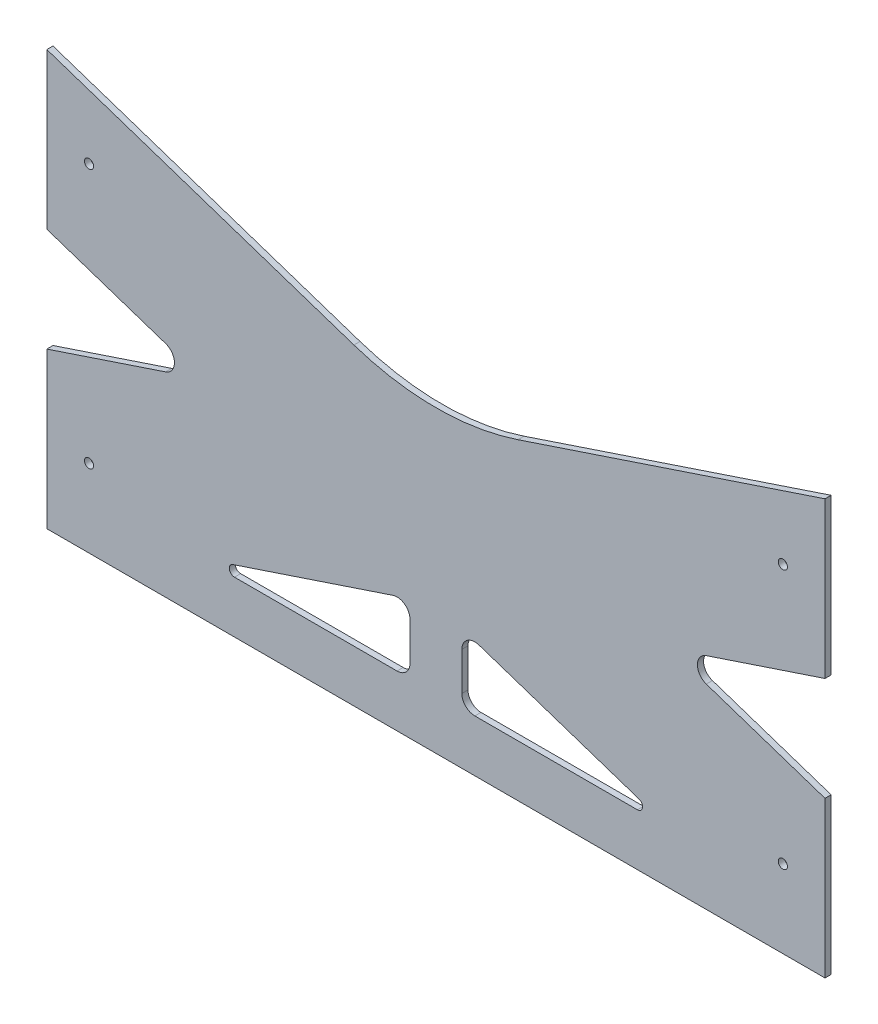
ISO-10303-21;
HEADER;
FILE_DESCRIPTION(('STEP AP214'),'2;1');
FILE_NAME('part.step','',(''),(''),'','','');
FILE_SCHEMA(('AUTOMOTIVE_DESIGN { 1 0 10303 214 1 1 1 1 }'));
ENDSEC;
DATA;
#1=APPLICATION_CONTEXT('core data for automotive mechanical design processes');
#2=APPLICATION_PROTOCOL_DEFINITION('international standard','automotive_design',2000,#1);
#3=PRODUCT_CONTEXT('',#1,'mechanical');
#4=PRODUCT('Part','Part','',(#3));
#5=PRODUCT_RELATED_PRODUCT_CATEGORY('part','',(#4));
#6=PRODUCT_DEFINITION_FORMATION('','',#4);
#7=PRODUCT_DEFINITION_CONTEXT('part definition',#1,'design');
#8=PRODUCT_DEFINITION('design','',#6,#7);
#9=PRODUCT_DEFINITION_SHAPE('','',#8);
#10=(LENGTH_UNIT() NAMED_UNIT(*) SI_UNIT(.MILLI.,.METRE.));
#11=(NAMED_UNIT(*) PLANE_ANGLE_UNIT() SI_UNIT($,.RADIAN.));
#12=(NAMED_UNIT(*) SI_UNIT($,.STERADIAN.) SOLID_ANGLE_UNIT());
#13=UNCERTAINTY_MEASURE_WITH_UNIT(LENGTH_MEASURE(1.E-05),#10,'distance_accuracy_value','');
#14=(GEOMETRIC_REPRESENTATION_CONTEXT(3) GLOBAL_UNCERTAINTY_ASSIGNED_CONTEXT((#13)) GLOBAL_UNIT_ASSIGNED_CONTEXT((#10,
#11,#12)) REPRESENTATION_CONTEXT('',''));
#15=CARTESIAN_POINT('',(0.,0.,0.));
#16=DIRECTION('',(0.,0.,1.));
#17=DIRECTION('',(1.,0.,0.));
#18=AXIS2_PLACEMENT_3D('',#15,#16,#17);
#19=CARTESIAN_POINT('',(-380.999999999886,25.4,195.185873570467));
#20=DIRECTION('',(0.,1.,0.));
#21=DIRECTION('',(1.,0.,-5.93192162057221E-13));
#22=AXIS2_PLACEMENT_3D('',#19,#20,#21);
#23=PLANE('',#22);
#24=DIRECTION('',(-1.,0.,5.93192162057221E-13));
#25=VECTOR('',#24,1.);
#26=CARTESIAN_POINT('',(-381.,25.4,3.00000000011297));
#27=LINE('',#26,#25);
#28=CARTESIAN_POINT('',(-91.8521852568278,25.4,2.99999999994145));
#29=VERTEX_POINT('',#28);
#30=CARTESIAN_POINT('',(-171.45,25.4,2.99999999998866));
#31=VERTEX_POINT('',#30);
#32=EDGE_CURVE('E277',#29,#31,#27,.T.);
#33=ORIENTED_EDGE('',*,*,#32,.F.);
#34=DIRECTION('',(0.,0.,1.));
#35=VECTOR('',#34,1.);
#36=CARTESIAN_POINT('',(-91.8521852568276,25.4,195.185873570467));
#37=LINE('',#36,#35);
#38=CARTESIAN_POINT('',(-91.8521852568278,25.4,-5.85519888599314E-11));
#39=VERTEX_POINT('',#38);
#40=EDGE_CURVE('E382',#29,#39,#37,.F.);
#41=ORIENTED_EDGE('',*,*,#40,.T.);
#42=DIRECTION('',(1.,0.,-5.93192162057221E-13));
#43=VECTOR('',#42,1.);
#44=CARTESIAN_POINT('',(-381.000000000001,25.4,1.12968228521693E-10));
#45=LINE('',#44,#43);
#46=CARTESIAN_POINT('',(-171.45,25.4,-1.13351890373989E-11));
#47=VERTEX_POINT('',#46);
#48=EDGE_CURVE('E272',#47,#39,#45,.T.);
#49=ORIENTED_EDGE('',*,*,#48,.F.);
#50=DIRECTION('',(0.,0.,1.));
#51=VECTOR('',#50,1.);
#52=CARTESIAN_POINT('',(-171.45,25.4,2.99999999999243));
#53=LINE('',#52,#51);
#54=EDGE_CURVE('E332',#47,#31,#53,.T.);
#55=ORIENTED_EDGE('',*,*,#54,.T.);
#56=EDGE_LOOP('',(#33,#41,#49,#55));
#57=FACE_BOUND('',#56,.T.);
#58=ADVANCED_FACE('F45',(#57),#23,.T.);
#59=CARTESIAN_POINT('',(-1.27675647831893E-12,127.,-1.13038051141601E-10));
#60=DIRECTION('',(-0.316227766016838,0.948683298050514,1.87583832226053E-13));
#61=DIRECTION('',(0.948683298050514,0.316227766016838,-5.62751496678159E-13));
#62=AXIS2_PLACEMENT_3D('',#59,#60,#61);
#63=PLANE('',#62);
#64=DIRECTION('',(-0.948683298050514,-0.316227766016838,5.62751496678159E-13));
#65=VECTOR('',#64,1.);
#66=CARTESIAN_POINT('',(4.9960036108132E-13,127.,2.99999999988696));
#67=LINE('',#66,#65);
#68=CARTESIAN_POINT('',(-211.558046314207,56.4806512285976,3.00000000001246));
#69=VERTEX_POINT('',#68);
#70=CARTESIAN_POINT('',(-289.951033268855,30.3496555770483,3.00000000005896));
#71=VERTEX_POINT('',#70);
#72=EDGE_CURVE('E297',#69,#71,#67,.T.);
#73=ORIENTED_EDGE('',*,*,#72,.T.);
#74=DIRECTION('',(-5.93192162057221E-13,0.,-1.));
#75=VECTOR('',#74,1.);
#76=CARTESIAN_POINT('',(-289.951033268857,30.3496555770483,5.89586291738768E-11));
#77=LINE('',#76,#75);
#78=CARTESIAN_POINT('',(-289.951033268856,30.3496555770483,5.89586291738768E-11));
#79=VERTEX_POINT('',#78);
#80=EDGE_CURVE('E384',#71,#79,#77,.T.);
#81=ORIENTED_EDGE('',*,*,#80,.T.);
#82=DIRECTION('',(-0.948683298050514,-0.316227766016838,5.62751496678159E-13));
#83=VECTOR('',#82,1.);
#84=CARTESIAN_POINT('',(-1.27675647831893E-12,127.,-1.13038051141601E-10));
#85=LINE('',#84,#83);
#86=CARTESIAN_POINT('',(-211.558046314207,56.4806512285982,1.24565237521245E-11));
#87=VERTEX_POINT('',#86);
#88=EDGE_CURVE('E283',#87,#79,#85,.T.);
#89=ORIENTED_EDGE('',*,*,#88,.F.);
#90=DIRECTION('',(0.,-1.9773072068574E-13,1.));
#91=VECTOR('',#90,1.);
#92=CARTESIAN_POINT('',(-211.558046314207,56.4806512285982,-1.26981892796459E-10));
#93=LINE('',#92,#91);
#94=EDGE_CURVE('E339',#87,#69,#93,.T.);
#95=ORIENTED_EDGE('',*,*,#94,.T.);
#96=EDGE_LOOP('',(#73,#81,#89,#95));
#97=FACE_BOUND('',#96,.T.);
#98=ADVANCED_FACE('F497',(#97),#63,.F.);
#99=CARTESIAN_POINT('',(4.9960036108132E-13,127.,2.99999999988696));
#100=VERTEX_POINT('',#99);
#101=CARTESIAN_POINT('',(-58.1275831721374,107.624138942621,2.99999999992144));
#102=VERTEX_POINT('',#101);
#103=EDGE_CURVE('E298',#100,#102,#67,.T.);
#104=ORIENTED_EDGE('',*,*,#103,.T.);
#105=DIRECTION('',(2.96596081028611E-13,0.,1.));
#106=VECTOR('',#105,1.);
#107=CARTESIAN_POINT('',(-58.1275831721383,107.624138942621,-7.2601377248204E-11));
#108=LINE('',#107,#106);
#109=CARTESIAN_POINT('',(-58.1275831721383,107.624138942621,-7.85572244045598E-11));
#110=VERTEX_POINT('',#109);
#111=EDGE_CURVE('E348',#102,#110,#108,.F.);
#112=ORIENTED_EDGE('',*,*,#111,.T.);
#113=CARTESIAN_POINT('',(-1.27675647831893E-12,127.,-1.13038051141601E-10));
#114=VERTEX_POINT('',#113);
#115=EDGE_CURVE('E285',#114,#110,#85,.T.);
#116=ORIENTED_EDGE('',*,*,#115,.F.);
#117=DIRECTION('',(5.93192162057221E-13,0.,1.));
#118=VECTOR('',#117,1.);
#119=CARTESIAN_POINT('',(-1.27675647831893E-12,127.,-1.13038051141601E-10));
#120=LINE('',#119,#118);
#121=EDGE_CURVE('E312',#114,#100,#120,.T.);
#122=ORIENTED_EDGE('',*,*,#121,.T.);
#123=EDGE_LOOP('',(#104,#112,#116,#122));
#124=FACE_BOUND('',#123,.T.);
#125=ADVANCED_FACE('F467',(#124),#63,.F.);
#126=CARTESIAN_POINT('',(-381.000000000001,76.2,1.12968228521693E-10));
#127=DIRECTION('',(0.316227766016838,-0.948683298050514,-1.87583832226053E-13));
#128=DIRECTION('',(-0.948683298050514,-0.316227766016838,5.62751496678159E-13));
#129=AXIS2_PLACEMENT_3D('',#126,#127,#128);
#130=PLANE('',#129);
#131=DIRECTION('',(0.948683298050514,0.316227766016838,-5.62751496678159E-13));
#132=VECTOR('',#131,1.);
#133=CARTESIAN_POINT('',(-381.,76.2,3.00000000011297));
#134=LINE('',#133,#132);
#135=CARTESIAN_POINT('',(-381.,76.2,3.00000000011297));
#136=VERTEX_POINT('',#135);
#137=CARTESIAN_POINT('',(-322.872416827862,95.5758610573791,3.00000000007849));
#138=VERTEX_POINT('',#137);
#139=EDGE_CURVE('E284',#136,#138,#134,.T.);
#140=ORIENTED_EDGE('',*,*,#139,.T.);
#141=DIRECTION('',(2.96596081028611E-13,0.,1.));
#142=VECTOR('',#141,1.);
#143=CARTESIAN_POINT('',(-322.872416827863,95.5758610573794,7.25315546282959E-11));
#144=LINE('',#143,#142);
#145=CARTESIAN_POINT('',(-322.872416827863,95.5758610573794,7.8487401784651E-11));
#146=VERTEX_POINT('',#145);
#147=EDGE_CURVE('E353',#138,#146,#144,.F.);
#148=ORIENTED_EDGE('',*,*,#147,.T.);
#149=DIRECTION('',(0.948683298050514,0.316227766016838,-5.62751496678159E-13));
#150=VECTOR('',#149,1.);
#151=CARTESIAN_POINT('',(-381.000000000001,76.2,1.12968228521693E-10));
#152=LINE('',#151,#150);
#153=CARTESIAN_POINT('',(-381.000000000001,76.2,1.12968228521693E-10));
#154=VERTEX_POINT('',#153);
#155=EDGE_CURVE('E291',#154,#146,#152,.T.);
#156=ORIENTED_EDGE('',*,*,#155,.F.);
#157=DIRECTION('',(5.93192162057221E-13,0.,1.));
#158=VECTOR('',#157,1.);
#159=CARTESIAN_POINT('',(-381.000000000001,76.2,1.12968228521693E-10));
#160=LINE('',#159,#158);
#161=EDGE_CURVE('E307',#154,#136,#160,.T.);
#162=ORIENTED_EDGE('',*,*,#161,.T.);
#163=EDGE_LOOP('',(#140,#148,#156,#162));
#164=FACE_BOUND('',#163,.T.);
#165=ADVANCED_FACE('F453',(#164),#130,.F.);
#166=CARTESIAN_POINT('',(-150.339073715862,153.086975428046,-2.38580250429171E-11));
#167=VERTEX_POINT('',#166);
#168=CARTESIAN_POINT('',(-1.27675647831893E-12,203.2,-1.13038051141601E-10));
#169=VERTEX_POINT('',#168);
#170=EDGE_CURVE('E290',#167,#169,#152,.T.);
#171=ORIENTED_EDGE('',*,*,#170,.F.);
#172=DIRECTION('',(-2.96596081028611E-13,0.,-1.));
#173=VECTOR('',#172,1.);
#174=CARTESIAN_POINT('',(-150.339073715861,153.086975428046,2.99999999998938));
#175=LINE('',#174,#173);
#176=CARTESIAN_POINT('',(-150.339073715862,153.086975428046,2.99999999997614));
#177=VERTEX_POINT('',#176);
#178=EDGE_CURVE('E318',#167,#177,#175,.F.);
#179=ORIENTED_EDGE('',*,*,#178,.T.);
#180=CARTESIAN_POINT('',(4.9960036108132E-13,203.2,2.99999999988696));
#181=VERTEX_POINT('',#180);
#182=EDGE_CURVE('E302',#177,#181,#134,.T.);
#183=ORIENTED_EDGE('',*,*,#182,.T.);
#184=DIRECTION('',(5.93192162057221E-13,0.,1.));
#185=VECTOR('',#184,1.);
#186=CARTESIAN_POINT('',(-1.27675647831893E-12,203.2,-1.13038051141601E-10));
#187=LINE('',#186,#185);
#188=EDGE_CURVE('E294',#169,#181,#187,.T.);
#189=ORIENTED_EDGE('',*,*,#188,.F.);
#190=EDGE_LOOP('',(#171,#179,#183,#189));
#191=FACE_BOUND('',#190,.T.);
#192=ADVANCED_FACE('F486',(#191),#130,.F.);
#193=CARTESIAN_POINT('',(-1.27675647831893E-12,203.2,-1.13038051141601E-10));
#194=DIRECTION('',(-1.,0.,5.93192162057221E-13));
#195=DIRECTION('',(5.93192162057221E-13,0.,1.));
#196=AXIS2_PLACEMENT_3D('',#193,#194,#195);
#197=PLANE('',#196);
#198=DIRECTION('',(0.,-1.,0.));
#199=VECTOR('',#198,1.);
#200=CARTESIAN_POINT('',(4.9960036108132E-13,203.2,2.99999999988696));
#201=LINE('',#200,#199);
#202=EDGE_CURVE('E279',#181,#100,#201,.T.);
#203=ORIENTED_EDGE('',*,*,#202,.T.);
#204=ORIENTED_EDGE('',*,*,#121,.F.);
#205=DIRECTION('',(0.,-1.,0.));
#206=VECTOR('',#205,1.);
#207=CARTESIAN_POINT('',(-1.27675647831893E-12,203.2,-1.13038051141601E-10));
#208=LINE('',#207,#206);
#209=EDGE_CURVE('E280',#169,#114,#208,.T.);
#210=ORIENTED_EDGE('',*,*,#209,.F.);
#211=ORIENTED_EDGE('',*,*,#188,.T.);
#212=EDGE_LOOP('',(#203,#204,#210,#211));
#213=FACE_BOUND('',#212,.T.);
#214=ADVANCED_FACE('F475',(#213),#197,.F.);
#215=CARTESIAN_POINT('',(-381.000000000001,0.,1.12968228521693E-10));
#216=DIRECTION('',(1.,0.,-5.93192162057221E-13));
#217=DIRECTION('',(0.,-1.,0.));
#218=AXIS2_PLACEMENT_3D('',#215,#216,#217);
#219=PLANE('',#218);
#220=ORIENTED_EDGE('',*,*,#161,.F.);
#221=DIRECTION('',(0.,1.,0.));
#222=VECTOR('',#221,1.);
#223=CARTESIAN_POINT('',(-381.000000000001,0.,1.12968228521693E-10));
#224=LINE('',#223,#222);
#225=CARTESIAN_POINT('',(-381.000000000001,0.,1.12968228521693E-10));
#226=VERTEX_POINT('',#225);
#227=EDGE_CURVE('E288',#226,#154,#224,.T.);
#228=ORIENTED_EDGE('',*,*,#227,.F.);
#229=DIRECTION('',(5.93192162057221E-13,0.,1.));
#230=VECTOR('',#229,1.);
#231=CARTESIAN_POINT('',(-381.000000000001,0.,1.12968228521693E-10));
#232=LINE('',#231,#230);
#233=CARTESIAN_POINT('',(-381.,0.,3.00000000011297));
#234=VERTEX_POINT('',#233);
#235=EDGE_CURVE('E310',#226,#234,#232,.T.);
#236=ORIENTED_EDGE('',*,*,#235,.T.);
#237=DIRECTION('',(0.,1.,0.));
#238=VECTOR('',#237,1.);
#239=CARTESIAN_POINT('',(-381.,0.,3.00000000011297));
#240=LINE('',#239,#238);
#241=EDGE_CURVE('E224',#234,#136,#240,.T.);
#242=ORIENTED_EDGE('',*,*,#241,.T.);
#243=EDGE_LOOP('',(#220,#228,#236,#242));
#244=FACE_BOUND('',#243,.T.);
#245=ADVANCED_FACE('F458',(#244),#219,.F.);
#246=CARTESIAN_POINT('',(-381.000000000001,0.,1.12968228521693E-10));
#247=DIRECTION('',(-5.93192162057221E-13,0.,-1.));
#248=DIRECTION('',(-1.,0.,5.93192162057221E-13));
#249=AXIS2_PLACEMENT_3D('',#246,#247,#248);
#250=PLANE('',#249);
#251=CARTESIAN_POINT('',(-20.6375000000011,165.1,1.22420149092173E-11));
#252=DIRECTION('',(0.,0.,-1.));
#253=DIRECTION('',(-1.,0.,0.));
#254=AXIS2_PLACEMENT_3D('',#251,#252,#253);
#255=CIRCLE('',#254,2.2479);
#256=CARTESIAN_POINT('',(-22.8854000000011,165.1,1.22420149092173E-11));
#257=VERTEX_POINT('',#256);
#258=EDGE_CURVE('E542',#257,#257,#255,.T.);
#259=ORIENTED_EDGE('',*,*,#258,.F.);
#260=EDGE_LOOP('',(#259));
#261=FACE_BOUND('',#260,.T.);
#262=CARTESIAN_POINT('',(-360.3625,165.1,2.13764222164106E-10));
#263=DIRECTION('',(0.,0.,-1.));
#264=DIRECTION('',(-1.,0.,0.));
#265=AXIS2_PLACEMENT_3D('',#262,#263,#264);
#266=CIRCLE('',#265,2.24790000000002);
#267=CARTESIAN_POINT('',(-362.6104,165.1,2.13764222164106E-10));
#268=VERTEX_POINT('',#267);
#269=EDGE_CURVE('E546',#268,#268,#266,.T.);
#270=ORIENTED_EDGE('',*,*,#269,.F.);
#271=EDGE_LOOP('',(#270));
#272=FACE_BOUND('',#271,.T.);
#273=CARTESIAN_POINT('',(-20.6375000000011,38.1,1.22420149092173E-11));
#274=DIRECTION('',(0.,0.,-1.));
#275=DIRECTION('',(-1.,0.,0.));
#276=AXIS2_PLACEMENT_3D('',#273,#274,#275);
#277=CIRCLE('',#276,2.2479);
#278=CARTESIAN_POINT('',(-22.8854000000011,38.1,1.22420149092173E-11));
#279=VERTEX_POINT('',#278);
#280=EDGE_CURVE('E550',#279,#279,#277,.T.);
#281=ORIENTED_EDGE('',*,*,#280,.F.);
#282=EDGE_LOOP('',(#281));
#283=FACE_BOUND('',#282,.T.);
#284=CARTESIAN_POINT('',(-360.3625,38.1,2.13764222164106E-10));
#285=DIRECTION('',(0.,0.,-1.));
#286=DIRECTION('',(-1.,0.,0.));
#287=AXIS2_PLACEMENT_3D('',#284,#285,#286);
#288=CIRCLE('',#287,2.24790000000002);
#289=CARTESIAN_POINT('',(-362.6104,38.1,2.13764222164106E-10));
#290=VERTEX_POINT('',#289);
#291=EDGE_CURVE('E553',#290,#290,#288,.T.);
#292=ORIENTED_EDGE('',*,*,#291,.F.);
#293=EDGE_LOOP('',(#292));
#294=FACE_BOUND('',#293,.T.);
#295=DIRECTION('',(0.,-1.,0.));
#296=VECTOR('',#295,1.);
#297=CARTESIAN_POINT('',(-203.2,63.4999999999999,7.49400541621981E-12));
#298=LINE('',#297,#296);
#299=CARTESIAN_POINT('',(-203.2,50.4565122859775,7.4940054162198E-12));
#300=VERTEX_POINT('',#299);
#301=CARTESIAN_POINT('',(-203.2,31.75,7.49400541621979E-12));
#302=VERTEX_POINT('',#301);
#303=EDGE_CURVE('E257',#300,#302,#298,.T.);
#304=ORIENTED_EDGE('',*,*,#303,.F.);
#305=CARTESIAN_POINT('',(-209.55,50.4565122859774,1.12654323369811E-11));
#306=DIRECTION('',(-5.93192162057221E-13,0.,-1.));
#307=DIRECTION('',(-1.,0.,5.93192162057221E-13));
#308=AXIS2_PLACEMENT_3D('',#305,#306,#307);
#309=CIRCLE('',#308,6.35);
#310=EDGE_CURVE('E365',#300,#87,#309,.F.);
#311=ORIENTED_EDGE('',*,*,#310,.T.);
#312=ORIENTED_EDGE('',*,*,#88,.T.);
#313=CARTESIAN_POINT('',(-289.147814743174,27.94,5.84822321595147E-11));
#314=DIRECTION('',(-5.93192162057221E-13,0.,-1.));
#315=DIRECTION('',(-1.,0.,5.93192162057221E-13));
#316=AXIS2_PLACEMENT_3D('',#313,#314,#315);
#317=CIRCLE('',#316,2.54);
#318=CARTESIAN_POINT('',(-289.147814743174,25.4,5.84822321595147E-11));
#319=VERTEX_POINT('',#318);
#320=EDGE_CURVE('E53',#79,#319,#317,.F.);
#321=ORIENTED_EDGE('',*,*,#320,.T.);
#322=CARTESIAN_POINT('',(-209.55,25.4,1.12654323369811E-11));
#323=VERTEX_POINT('',#322);
#324=EDGE_CURVE('E274',#319,#323,#45,.T.);
#325=ORIENTED_EDGE('',*,*,#324,.T.);
#326=CARTESIAN_POINT('',(-209.55,31.75,1.12618248060414E-11));
#327=DIRECTION('',(-5.93192162057221E-13,0.,-1.));
#328=DIRECTION('',(-1.,0.,5.93192162057221E-13));
#329=AXIS2_PLACEMENT_3D('',#326,#327,#328);
#330=CIRCLE('',#329,6.35);
#331=EDGE_CURVE('E357',#323,#302,#330,.F.);
#332=ORIENTED_EDGE('',*,*,#331,.T.);
#333=EDGE_LOOP('',(#304,#311,#312,#321,#325,#332));
#334=FACE_BOUND('',#333,.T.);
#335=DIRECTION('',(0.948683298050514,-0.316227766016838,0.));
#336=VECTOR('',#335,1.);
#337=CARTESIAN_POINT('',(-381.,127.,0.));
#338=LINE('',#337,#336);
#339=CARTESIAN_POINT('',(-169.441953685793,56.4806512285976,0.));
#340=VERTEX_POINT('',#339);
#341=CARTESIAN_POINT('',(-91.0489667311449,30.3496555770483,0.));
#342=VERTEX_POINT('',#341);
#343=EDGE_CURVE('E256',#340,#342,#338,.T.);
#344=ORIENTED_EDGE('',*,*,#343,.F.);
#345=CARTESIAN_POINT('',(-171.45,50.4565122859768,-1.13351168729015E-11));
#346=DIRECTION('',(-5.93192162057221E-13,0.,-1.));
#347=DIRECTION('',(-1.,0.,5.93192162057221E-13));
#348=AXIS2_PLACEMENT_3D('',#345,#346,#347);
#349=CIRCLE('',#348,6.35);
#350=CARTESIAN_POINT('',(-177.8,50.4565122859768,-7.57033324916278E-12));
#351=VERTEX_POINT('',#350);
#352=EDGE_CURVE('E367',#340,#351,#349,.F.);
#353=ORIENTED_EDGE('',*,*,#352,.T.);
#354=DIRECTION('',(0.,1.,0.));
#355=VECTOR('',#354,1.);
#356=CARTESIAN_POINT('',(-177.8,63.4999999999999,-7.57033324916279E-12));
#357=LINE('',#356,#355);
#358=CARTESIAN_POINT('',(-177.8,31.75,-7.57033324916277E-12));
#359=VERTEX_POINT('',#358);
#360=EDGE_CURVE('E426',#359,#351,#357,.T.);
#361=ORIENTED_EDGE('',*,*,#360,.F.);
#362=CARTESIAN_POINT('',(-171.45,31.75,-1.13520304267922E-11));
#363=DIRECTION('',(-5.93192162057221E-13,0.,-1.));
#364=DIRECTION('',(-1.,0.,5.93192162057221E-13));
#365=AXIS2_PLACEMENT_3D('',#362,#363,#364);
#366=CIRCLE('',#365,6.35);
#367=EDGE_CURVE('E361',#359,#47,#366,.F.);
#368=ORIENTED_EDGE('',*,*,#367,.T.);
#369=ORIENTED_EDGE('',*,*,#48,.T.);
#370=CARTESIAN_POINT('',(-91.8521852568276,27.94,-5.85521214846452E-11));
#371=DIRECTION('',(-5.93192162057221E-13,0.,-1.));
#372=DIRECTION('',(-1.,0.,5.93192162057221E-13));
#373=AXIS2_PLACEMENT_3D('',#370,#371,#372);
#374=CIRCLE('',#373,2.54);
#375=EDGE_CURVE('E390',#39,#342,#374,.F.);
#376=ORIENTED_EDGE('',*,*,#375,.T.);
#377=EDGE_LOOP('',(#344,#353,#361,#368,#369,#376));
#378=FACE_BOUND('',#377,.T.);
#379=ORIENTED_EDGE('',*,*,#155,.T.);
#380=CARTESIAN_POINT('',(-324.88046314207,101.6,7.96784513368287E-11));
#381=DIRECTION('',(-5.93192162057221E-13,0.,-1.));
#382=DIRECTION('',(-1.,0.,5.93192162057221E-13));
#383=AXIS2_PLACEMENT_3D('',#380,#381,#382);
#384=CIRCLE('',#383,6.35);
#385=CARTESIAN_POINT('',(-322.872416827863,107.624138942621,0.));
#386=VERTEX_POINT('',#385);
#387=EDGE_CURVE('E377',#146,#386,#384,.F.);
#388=ORIENTED_EDGE('',*,*,#387,.T.);
#389=CARTESIAN_POINT('',(-381.,127.,0.));
#390=VERTEX_POINT('',#389);
#391=EDGE_CURVE('E258',#390,#386,#338,.T.);
#392=ORIENTED_EDGE('',*,*,#391,.F.);
#393=DIRECTION('',(0.,-1.,0.));
#394=VECTOR('',#393,1.);
#395=CARTESIAN_POINT('',(-381.,203.2,0.));
#396=LINE('',#395,#394);
#397=CARTESIAN_POINT('',(-381.,203.2,0.));
#398=VERTEX_POINT('',#397);
#399=EDGE_CURVE('E253',#398,#390,#396,.T.);
#400=ORIENTED_EDGE('',*,*,#399,.F.);
#401=DIRECTION('',(-0.948683298050514,0.316227766016838,0.));
#402=VECTOR('',#401,1.);
#403=CARTESIAN_POINT('',(0.,76.2,0.));
#404=LINE('',#403,#402);
#405=CARTESIAN_POINT('',(-230.660926284139,153.086975428046,0.));
#406=VERTEX_POINT('',#405);
#407=EDGE_CURVE('E263',#406,#398,#404,.T.);
#408=ORIENTED_EDGE('',*,*,#407,.F.);
#409=CARTESIAN_POINT('',(-190.500000000001,273.569754280462,0.));
#410=DIRECTION('',(-5.93192162057221E-13,0.,-1.));
#411=DIRECTION('',(-1.,0.,5.93192162057221E-13));
#412=AXIS2_PLACEMENT_3D('',#409,#410,#411);
#413=CIRCLE('',#412,127.);
#414=EDGE_CURVE('E320',#406,#167,#413,.F.);
#415=ORIENTED_EDGE('',*,*,#414,.T.);
#416=ORIENTED_EDGE('',*,*,#170,.T.);
#417=ORIENTED_EDGE('',*,*,#209,.T.);
#418=ORIENTED_EDGE('',*,*,#115,.T.);
#419=CARTESIAN_POINT('',(-56.1195368579314,101.6,-7.97482739567368E-11));
#420=DIRECTION('',(-5.93192162057221E-13,0.,-1.));
#421=DIRECTION('',(-1.,0.,5.93192162057221E-13));
#422=AXIS2_PLACEMENT_3D('',#419,#420,#421);
#423=CIRCLE('',#422,6.35);
#424=CARTESIAN_POINT('',(-58.1275831721383,95.5758610573794,0.));
#425=VERTEX_POINT('',#424);
#426=EDGE_CURVE('E373',#110,#425,#423,.F.);
#427=ORIENTED_EDGE('',*,*,#426,.T.);
#428=CARTESIAN_POINT('',(0.,76.2,0.));
#429=VERTEX_POINT('',#428);
#430=EDGE_CURVE('E264',#429,#425,#404,.T.);
#431=ORIENTED_EDGE('',*,*,#430,.F.);
#432=DIRECTION('',(0.,1.,0.));
#433=VECTOR('',#432,1.);
#434=CARTESIAN_POINT('',(0.,0.,0.));
#435=LINE('',#434,#433);
#436=CARTESIAN_POINT('',(0.,0.,0.));
#437=VERTEX_POINT('',#436);
#438=EDGE_CURVE('E261',#437,#429,#435,.T.);
#439=ORIENTED_EDGE('',*,*,#438,.F.);
#440=DIRECTION('',(-1.,0.,5.93192162057221E-13));
#441=VECTOR('',#440,1.);
#442=CARTESIAN_POINT('',(-381.000000000001,0.,1.12968228521693E-10));
#443=LINE('',#442,#441);
#444=EDGE_CURVE('E228',#437,#226,#443,.T.);
#445=ORIENTED_EDGE('',*,*,#444,.T.);
#446=ORIENTED_EDGE('',*,*,#227,.T.);
#447=EDGE_LOOP('',(#379,#388,#392,#400,#408,#415,#416,#417,#418,#427,#431,#439,#445,#446));
#448=FACE_BOUND('',#447,.T.);
#449=ADVANCED_FACE('F396',(#261,#272,#283,#294,#334,#378,#448),#250,.T.);
#450=CARTESIAN_POINT('',(-381.,0.,3.00000000011297));
#451=DIRECTION('',(-5.93192162057221E-13,0.,-1.));
#452=DIRECTION('',(-1.,0.,5.93192162057221E-13));
#453=AXIS2_PLACEMENT_3D('',#450,#451,#452);
#454=PLANE('',#453);
#455=CARTESIAN_POINT('',(-20.6375000000011,165.1,3.00000000012521));
#456=DIRECTION('',(0.,0.,-1.));
#457=DIRECTION('',(-1.,0.,0.));
#458=AXIS2_PLACEMENT_3D('',#455,#456,#457);
#459=CIRCLE('',#458,2.2479);
#460=CARTESIAN_POINT('',(-22.8854000000011,165.1,3.00000000012521));
#461=VERTEX_POINT('',#460);
#462=EDGE_CURVE('E565',#461,#461,#459,.T.);
#463=ORIENTED_EDGE('',*,*,#462,.T.);
#464=EDGE_LOOP('',(#463));
#465=FACE_BOUND('',#464,.T.);
#466=CARTESIAN_POINT('',(-360.3625,165.1,3.00000000032673));
#467=DIRECTION('',(0.,0.,-1.));
#468=DIRECTION('',(-1.,0.,0.));
#469=AXIS2_PLACEMENT_3D('',#466,#467,#468);
#470=CIRCLE('',#469,2.24790000000002);
#471=CARTESIAN_POINT('',(-362.6104,165.1,3.00000000032673));
#472=VERTEX_POINT('',#471);
#473=EDGE_CURVE('E561',#472,#472,#470,.T.);
#474=ORIENTED_EDGE('',*,*,#473,.T.);
#475=EDGE_LOOP('',(#474));
#476=FACE_BOUND('',#475,.T.);
#477=CARTESIAN_POINT('',(-20.6375000000011,38.1,3.00000000012521));
#478=DIRECTION('',(0.,0.,-1.));
#479=DIRECTION('',(-1.,0.,0.));
#480=AXIS2_PLACEMENT_3D('',#477,#478,#479);
#481=CIRCLE('',#480,2.2479);
#482=CARTESIAN_POINT('',(-22.8854000000011,38.1,3.00000000012521));
#483=VERTEX_POINT('',#482);
#484=EDGE_CURVE('E555',#483,#483,#481,.T.);
#485=ORIENTED_EDGE('',*,*,#484,.T.);
#486=EDGE_LOOP('',(#485));
#487=FACE_BOUND('',#486,.T.);
#488=CARTESIAN_POINT('',(-360.3625,38.1,3.00000000032673));
#489=DIRECTION('',(0.,0.,-1.));
#490=DIRECTION('',(-1.,0.,0.));
#491=AXIS2_PLACEMENT_3D('',#488,#489,#490);
#492=CIRCLE('',#491,2.24790000000002);
#493=CARTESIAN_POINT('',(-362.6104,38.1,3.00000000032673));
#494=VERTEX_POINT('',#493);
#495=EDGE_CURVE('E431',#494,#494,#492,.T.);
#496=ORIENTED_EDGE('',*,*,#495,.T.);
#497=EDGE_LOOP('',(#496));
#498=FACE_BOUND('',#497,.T.);
#499=ORIENTED_EDGE('',*,*,#72,.F.);
#500=CARTESIAN_POINT('',(-209.55,50.4565122859769,3.00000000001126));
#501=DIRECTION('',(-5.93192162057221E-13,0.,-1.));
#502=DIRECTION('',(-1.,0.,5.93192162057221E-13));
#503=AXIS2_PLACEMENT_3D('',#500,#501,#502);
#504=CIRCLE('',#503,6.35);
#505=CARTESIAN_POINT('',(-203.2,50.4565122859769,2.99999999988696));
#506=VERTEX_POINT('',#505);
#507=EDGE_CURVE('E363',#69,#506,#504,.T.);
#508=ORIENTED_EDGE('',*,*,#507,.T.);
#509=DIRECTION('',(0.,-1.,0.));
#510=VECTOR('',#509,1.);
#511=CARTESIAN_POINT('',(-203.2,63.4999999999999,2.99999999988696));
#512=LINE('',#511,#510);
#513=CARTESIAN_POINT('',(-203.2,31.75,2.99999999988696));
#514=VERTEX_POINT('',#513);
#515=EDGE_CURVE('E427',#506,#514,#512,.T.);
#516=ORIENTED_EDGE('',*,*,#515,.T.);
#517=CARTESIAN_POINT('',(-209.55,31.75,3.00000000001126));
#518=DIRECTION('',(-5.93192162057221E-13,0.,-1.));
#519=DIRECTION('',(-1.,0.,5.93192162057221E-13));
#520=AXIS2_PLACEMENT_3D('',#517,#518,#519);
#521=CIRCLE('',#520,6.35);
#522=CARTESIAN_POINT('',(-209.55,25.4,3.00000000001126));
#523=VERTEX_POINT('',#522);
#524=EDGE_CURVE('E355',#514,#523,#521,.T.);
#525=ORIENTED_EDGE('',*,*,#524,.T.);
#526=CARTESIAN_POINT('',(-289.147814743172,25.4,3.00000000005848));
#527=VERTEX_POINT('',#526);
#528=EDGE_CURVE('E227',#523,#527,#27,.T.);
#529=ORIENTED_EDGE('',*,*,#528,.T.);
#530=CARTESIAN_POINT('',(-289.147814743172,27.94,3.00000000005848));
#531=DIRECTION('',(-5.93192162057221E-13,0.,-1.));
#532=DIRECTION('',(-1.,0.,5.93192162057221E-13));
#533=AXIS2_PLACEMENT_3D('',#530,#531,#532);
#534=CIRCLE('',#533,2.54);
#535=EDGE_CURVE('E11',#527,#71,#534,.T.);
#536=ORIENTED_EDGE('',*,*,#535,.T.);
#537=EDGE_LOOP('',(#499,#508,#516,#525,#529,#536));
#538=FACE_BOUND('',#537,.T.);
#539=DIRECTION('',(0.948683298050514,-0.316227766016838,0.));
#540=VECTOR('',#539,1.);
#541=CARTESIAN_POINT('',(-381.,127.,3.));
#542=LINE('',#541,#540);
#543=CARTESIAN_POINT('',(-169.441953685793,56.4806512285976,3.));
#544=VERTEX_POINT('',#543);
#545=CARTESIAN_POINT('',(-91.0489667311449,30.3496555770483,3.));
#546=VERTEX_POINT('',#545);
#547=EDGE_CURVE('E248',#544,#546,#542,.T.);
#548=ORIENTED_EDGE('',*,*,#547,.T.);
#549=CARTESIAN_POINT('',(-91.8521852568276,27.94,2.99999999994145));
#550=DIRECTION('',(-5.93192162057221E-13,0.,-1.));
#551=DIRECTION('',(-1.,0.,5.93192162057221E-13));
#552=AXIS2_PLACEMENT_3D('',#549,#550,#551);
#553=CIRCLE('',#552,2.54);
#554=EDGE_CURVE('E388',#546,#29,#553,.T.);
#555=ORIENTED_EDGE('',*,*,#554,.T.);
#556=ORIENTED_EDGE('',*,*,#32,.T.);
#557=CARTESIAN_POINT('',(-171.45,31.75,2.99999999998865));
#558=DIRECTION('',(-5.93192162057221E-13,0.,-1.));
#559=DIRECTION('',(-1.,0.,5.93192162057221E-13));
#560=AXIS2_PLACEMENT_3D('',#557,#558,#559);
#561=CIRCLE('',#560,6.35);
#562=CARTESIAN_POINT('',(-177.8,31.75,2.99999999988696));
#563=VERTEX_POINT('',#562);
#564=EDGE_CURVE('E359',#31,#563,#561,.T.);
#565=ORIENTED_EDGE('',*,*,#564,.T.);
#566=DIRECTION('',(0.,1.,0.));
#567=VECTOR('',#566,1.);
#568=CARTESIAN_POINT('',(-177.8,63.4999999999999,2.99999999988696));
#569=LINE('',#568,#567);
#570=CARTESIAN_POINT('',(-177.8,50.4565122859768,2.99999999988696));
#571=VERTEX_POINT('',#570);
#572=EDGE_CURVE('E419',#563,#571,#569,.T.);
#573=ORIENTED_EDGE('',*,*,#572,.T.);
#574=CARTESIAN_POINT('',(-171.45,50.4565122859768,2.99999999998866));
#575=DIRECTION('',(-5.93192162057221E-13,0.,-1.));
#576=DIRECTION('',(-1.,0.,5.93192162057221E-13));
#577=AXIS2_PLACEMENT_3D('',#574,#575,#576);
#578=CIRCLE('',#577,6.35);
#579=EDGE_CURVE('E369',#571,#544,#578,.T.);
#580=ORIENTED_EDGE('',*,*,#579,.T.);
#581=EDGE_LOOP('',(#548,#555,#556,#565,#573,#580));
#582=FACE_BOUND('',#581,.T.);
#583=DIRECTION('',(1.,0.,-5.93192162057221E-13));
#584=VECTOR('',#583,1.);
#585=CARTESIAN_POINT('',(-381.,0.,3.00000000011297));
#586=LINE('',#585,#584);
#587=CARTESIAN_POINT('',(0.,0.,3.));
#588=VERTEX_POINT('',#587);
#589=EDGE_CURVE('E216',#234,#588,#586,.T.);
#590=ORIENTED_EDGE('',*,*,#589,.T.);
#591=DIRECTION('',(0.,1.,0.));
#592=VECTOR('',#591,1.);
#593=CARTESIAN_POINT('',(0.,0.,3.));
#594=LINE('',#593,#592);
#595=CARTESIAN_POINT('',(0.,76.2,3.));
#596=VERTEX_POINT('',#595);
#597=EDGE_CURVE('E221',#588,#596,#594,.T.);
#598=ORIENTED_EDGE('',*,*,#597,.T.);
#599=DIRECTION('',(-0.948683298050514,0.316227766016838,0.));
#600=VECTOR('',#599,1.);
#601=CARTESIAN_POINT('',(0.,76.2,3.));
#602=LINE('',#601,#600);
#603=CARTESIAN_POINT('',(-58.1275831721374,95.5758610573791,3.));
#604=VERTEX_POINT('',#603);
#605=EDGE_CURVE('E245',#596,#604,#602,.T.);
#606=ORIENTED_EDGE('',*,*,#605,.T.);
#607=CARTESIAN_POINT('',(-56.1195368579305,101.6,2.99999999992025));
#608=DIRECTION('',(-5.93192162057221E-13,0.,-1.));
#609=DIRECTION('',(-1.,0.,5.93192162057221E-13));
#610=AXIS2_PLACEMENT_3D('',#607,#608,#609);
#611=CIRCLE('',#610,6.35);
#612=EDGE_CURVE('E371',#604,#102,#611,.T.);
#613=ORIENTED_EDGE('',*,*,#612,.T.);
#614=ORIENTED_EDGE('',*,*,#103,.F.);
#615=ORIENTED_EDGE('',*,*,#202,.F.);
#616=ORIENTED_EDGE('',*,*,#182,.F.);
#617=CARTESIAN_POINT('',(-190.5,273.569754280461,2.99999999999996));
#618=DIRECTION('',(-5.93192162057221E-13,0.,-1.));
#619=DIRECTION('',(-1.,0.,5.93192162057221E-13));
#620=AXIS2_PLACEMENT_3D('',#617,#618,#619);
#621=CIRCLE('',#620,127.);
#622=CARTESIAN_POINT('',(-230.660926284138,153.086975428046,3.));
#623=VERTEX_POINT('',#622);
#624=EDGE_CURVE('E322',#177,#623,#621,.T.);
#625=ORIENTED_EDGE('',*,*,#624,.T.);
#626=CARTESIAN_POINT('',(-381.,203.2,3.));
#627=VERTEX_POINT('',#626);
#628=EDGE_CURVE('E242',#623,#627,#602,.T.);
#629=ORIENTED_EDGE('',*,*,#628,.T.);
#630=DIRECTION('',(0.,-1.,0.));
#631=VECTOR('',#630,1.);
#632=CARTESIAN_POINT('',(-381.,203.2,3.));
#633=LINE('',#632,#631);
#634=CARTESIAN_POINT('',(-381.,127.,3.));
#635=VERTEX_POINT('',#634);
#636=EDGE_CURVE('E267',#627,#635,#633,.T.);
#637=ORIENTED_EDGE('',*,*,#636,.T.);
#638=CARTESIAN_POINT('',(-322.872416827862,107.624138942621,3.));
#639=VERTEX_POINT('',#638);
#640=EDGE_CURVE('E243',#635,#639,#542,.T.);
#641=ORIENTED_EDGE('',*,*,#640,.T.);
#642=CARTESIAN_POINT('',(-324.880463142069,101.6,3.00000000007968));
#643=DIRECTION('',(-5.93192162057221E-13,0.,-1.));
#644=DIRECTION('',(-1.,0.,5.93192162057221E-13));
#645=AXIS2_PLACEMENT_3D('',#642,#643,#644);
#646=CIRCLE('',#645,6.35);
#647=EDGE_CURVE('E375',#639,#138,#646,.T.);
#648=ORIENTED_EDGE('',*,*,#647,.T.);
#649=ORIENTED_EDGE('',*,*,#139,.F.);
#650=ORIENTED_EDGE('',*,*,#241,.F.);
#651=EDGE_LOOP('',(#590,#598,#606,#613,#614,#615,#616,#625,#629,#637,#641,#648,#649,#650));
#652=FACE_BOUND('',#651,.T.);
#653=ADVANCED_FACE('F218',(#465,#476,#487,#498,#538,#582,#652),#454,.F.);
#654=ORIENTED_EDGE('',*,*,#324,.F.);
#655=DIRECTION('',(-5.93192162057221E-13,0.,-1.));
#656=VECTOR('',#655,1.);
#657=CARTESIAN_POINT('',(-289.147814743058,25.4,195.185873570412));
#658=LINE('',#657,#656);
#659=EDGE_CURVE('E66',#319,#527,#658,.F.);
#660=ORIENTED_EDGE('',*,*,#659,.T.);
#661=ORIENTED_EDGE('',*,*,#528,.F.);
#662=DIRECTION('',(0.,0.,1.));
#663=VECTOR('',#662,1.);
#664=CARTESIAN_POINT('',(-209.55,25.4,7.50094431012371E-12));
#665=LINE('',#664,#663);
#666=EDGE_CURVE('E329',#523,#323,#665,.F.);
#667=ORIENTED_EDGE('',*,*,#666,.T.);
#668=EDGE_LOOP('',(#654,#660,#661,#667));
#669=FACE_BOUND('',#668,.T.);
#670=ADVANCED_FACE('F499',(#669),#23,.T.);
#671=CARTESIAN_POINT('',(-380.999999999886,0.,195.185873570467));
#672=DIRECTION('',(0.,-1.,0.));
#673=DIRECTION('',(-1.,0.,5.93192162057221E-13));
#674=AXIS2_PLACEMENT_3D('',#671,#672,#673);
#675=PLANE('',#674);
#676=ORIENTED_EDGE('',*,*,#589,.F.);
#677=ORIENTED_EDGE('',*,*,#235,.F.);
#678=ORIENTED_EDGE('',*,*,#444,.F.);
#679=DIRECTION('',(0.,0.,-1.));
#680=VECTOR('',#679,1.);
#681=CARTESIAN_POINT('',(0.,0.,3.));
#682=LINE('',#681,#680);
#683=EDGE_CURVE('E231',#588,#437,#682,.T.);
#684=ORIENTED_EDGE('',*,*,#683,.F.);
#685=EDGE_LOOP('',(#676,#677,#678,#684));
#686=FACE_BOUND('',#685,.T.);
#687=ADVANCED_FACE('F232',(#686),#675,.T.);
#688=CARTESIAN_POINT('',(-381.,203.2,3.));
#689=DIRECTION('',(1.,0.,0.));
#690=DIRECTION('',(0.,0.,-1.));
#691=AXIS2_PLACEMENT_3D('',#688,#689,#690);
#692=PLANE('',#691);
#693=ORIENTED_EDGE('',*,*,#399,.T.);
#694=DIRECTION('',(0.,0.,-1.));
#695=VECTOR('',#694,1.);
#696=CARTESIAN_POINT('',(-381.,127.,3.));
#697=LINE('',#696,#695);
#698=EDGE_CURVE('E236',#635,#390,#697,.T.);
#699=ORIENTED_EDGE('',*,*,#698,.F.);
#700=ORIENTED_EDGE('',*,*,#636,.F.);
#701=DIRECTION('',(0.,0.,-1.));
#702=VECTOR('',#701,1.);
#703=CARTESIAN_POINT('',(-381.,203.2,3.));
#704=LINE('',#703,#702);
#705=EDGE_CURVE('E252',#627,#398,#704,.T.);
#706=ORIENTED_EDGE('',*,*,#705,.T.);
#707=EDGE_LOOP('',(#693,#699,#700,#706));
#708=FACE_BOUND('',#707,.T.);
#709=ADVANCED_FACE('F443',(#708),#692,.F.);
#710=CARTESIAN_POINT('',(0.,76.2,3.));
#711=DIRECTION('',(-0.316227766016838,-0.948683298050514,0.));
#712=DIRECTION('',(0.948683298050514,-0.316227766016838,0.));
#713=AXIS2_PLACEMENT_3D('',#710,#711,#712);
#714=PLANE('',#713);
#715=ORIENTED_EDGE('',*,*,#628,.F.);
#716=DIRECTION('',(-2.96596081028611E-13,0.,-1.));
#717=VECTOR('',#716,1.);
#718=CARTESIAN_POINT('',(-230.660926284139,153.086975428046,1.3235072759965E-11));
#719=LINE('',#718,#717);
#720=EDGE_CURVE('E315',#623,#406,#719,.T.);
#721=ORIENTED_EDGE('',*,*,#720,.T.);
#722=ORIENTED_EDGE('',*,*,#407,.T.);
#723=ORIENTED_EDGE('',*,*,#705,.F.);
#724=EDGE_LOOP('',(#715,#721,#722,#723));
#725=FACE_BOUND('',#724,.T.);
#726=ADVANCED_FACE('F485',(#725),#714,.F.);
#727=CARTESIAN_POINT('',(-381.,127.,3.));
#728=DIRECTION('',(0.316227766016838,0.948683298050514,0.));
#729=DIRECTION('',(-0.948683298050514,0.316227766016838,0.));
#730=AXIS2_PLACEMENT_3D('',#727,#728,#729);
#731=PLANE('',#730);
#732=ORIENTED_EDGE('',*,*,#391,.T.);
#733=DIRECTION('',(2.96596081028611E-13,0.,1.));
#734=VECTOR('',#733,1.);
#735=CARTESIAN_POINT('',(-322.872416827862,107.624138942621,3.00000000007372));
#736=LINE('',#735,#734);
#737=EDGE_CURVE('E350',#386,#639,#736,.T.);
#738=ORIENTED_EDGE('',*,*,#737,.T.);
#739=ORIENTED_EDGE('',*,*,#640,.F.);
#740=ORIENTED_EDGE('',*,*,#698,.T.);
#741=EDGE_LOOP('',(#732,#738,#739,#740));
#742=FACE_BOUND('',#741,.T.);
#743=ADVANCED_FACE('F446',(#742),#731,.F.);
#744=ORIENTED_EDGE('',*,*,#343,.T.);
#745=DIRECTION('',(0.,0.,1.));
#746=VECTOR('',#745,1.);
#747=CARTESIAN_POINT('',(-91.0489667311449,30.3496555770483,3.));
#748=LINE('',#747,#746);
#749=EDGE_CURVE('E379',#342,#546,#748,.T.);
#750=ORIENTED_EDGE('',*,*,#749,.T.);
#751=ORIENTED_EDGE('',*,*,#547,.F.);
#752=DIRECTION('',(0.,0.,-1.));
#753=VECTOR('',#752,1.);
#754=CARTESIAN_POINT('',(-169.441953685793,56.4806512285976,3.));
#755=LINE('',#754,#753);
#756=EDGE_CURVE('E342',#544,#340,#755,.T.);
#757=ORIENTED_EDGE('',*,*,#756,.T.);
#758=EDGE_LOOP('',(#744,#750,#751,#757));
#759=FACE_BOUND('',#758,.T.);
#760=ADVANCED_FACE('F403',(#759),#731,.F.);
#761=ORIENTED_EDGE('',*,*,#430,.T.);
#762=DIRECTION('',(2.96596081028611E-13,0.,1.));
#763=VECTOR('',#762,1.);
#764=CARTESIAN_POINT('',(-58.1275831721375,95.5758610573791,2.99999999999404));
#765=LINE('',#764,#763);
#766=EDGE_CURVE('E345',#425,#604,#765,.T.);
#767=ORIENTED_EDGE('',*,*,#766,.T.);
#768=ORIENTED_EDGE('',*,*,#605,.F.);
#769=DIRECTION('',(0.,0.,-1.));
#770=VECTOR('',#769,1.);
#771=CARTESIAN_POINT('',(0.,76.2,3.));
#772=LINE('',#771,#770);
#773=EDGE_CURVE('E237',#596,#429,#772,.T.);
#774=ORIENTED_EDGE('',*,*,#773,.T.);
#775=EDGE_LOOP('',(#761,#767,#768,#774));
#776=FACE_BOUND('',#775,.T.);
#777=ADVANCED_FACE('F461',(#776),#714,.F.);
#778=CARTESIAN_POINT('',(0.,0.,3.));
#779=DIRECTION('',(-1.,0.,0.));
#780=DIRECTION('',(0.,-1.,0.));
#781=AXIS2_PLACEMENT_3D('',#778,#779,#780);
#782=PLANE('',#781);
#783=ORIENTED_EDGE('',*,*,#773,.F.);
#784=ORIENTED_EDGE('',*,*,#597,.F.);
#785=ORIENTED_EDGE('',*,*,#683,.T.);
#786=ORIENTED_EDGE('',*,*,#438,.T.);
#787=EDGE_LOOP('',(#783,#784,#785,#786));
#788=FACE_BOUND('',#787,.T.);
#789=ADVANCED_FACE('F239',(#788),#782,.F.);
#790=CARTESIAN_POINT('',(-203.2,63.4999999999999,-45.7905011983926));
#791=DIRECTION('',(-1.,0.,0.));
#792=DIRECTION('',(0.,-1.,0.));
#793=AXIS2_PLACEMENT_3D('',#790,#791,#792);
#794=PLANE('',#793);
#795=ORIENTED_EDGE('',*,*,#303,.T.);
#796=DIRECTION('',(0.,0.,1.));
#797=VECTOR('',#796,1.);
#798=CARTESIAN_POINT('',(-203.2,31.75,2.99999999988696));
#799=LINE('',#798,#797);
#800=EDGE_CURVE('E326',#302,#514,#799,.T.);
#801=ORIENTED_EDGE('',*,*,#800,.T.);
#802=ORIENTED_EDGE('',*,*,#515,.F.);
#803=DIRECTION('',(0.,-1.9773072068574E-13,1.));
#804=VECTOR('',#803,1.);
#805=CARTESIAN_POINT('',(-203.2,50.4565122859865,-45.7905011983952));
#806=LINE('',#805,#804);
#807=EDGE_CURVE('E324',#506,#300,#806,.F.);
#808=ORIENTED_EDGE('',*,*,#807,.T.);
#809=EDGE_LOOP('',(#795,#801,#802,#808));
#810=FACE_BOUND('',#809,.T.);
#811=ADVANCED_FACE('F529',(#810),#794,.T.);
#812=CARTESIAN_POINT('',(-177.8,63.4999999999999,-45.7905011983926));
#813=DIRECTION('',(1.,0.,0.));
#814=DIRECTION('',(0.,1.,0.));
#815=AXIS2_PLACEMENT_3D('',#812,#813,#814);
#816=PLANE('',#815);
#817=ORIENTED_EDGE('',*,*,#572,.F.);
#818=DIRECTION('',(0.,0.,1.));
#819=VECTOR('',#818,1.);
#820=CARTESIAN_POINT('',(-177.8,31.75,-7.57727214306669E-12));
#821=LINE('',#820,#819);
#822=EDGE_CURVE('E337',#563,#359,#821,.F.);
#823=ORIENTED_EDGE('',*,*,#822,.T.);
#824=ORIENTED_EDGE('',*,*,#360,.T.);
#825=DIRECTION('',(0.,0.,-1.));
#826=VECTOR('',#825,1.);
#827=CARTESIAN_POINT('',(-177.8,50.4565122859768,-45.7905011983926));
#828=LINE('',#827,#826);
#829=EDGE_CURVE('E335',#351,#571,#828,.F.);
#830=ORIENTED_EDGE('',*,*,#829,.T.);
#831=EDGE_LOOP('',(#817,#823,#824,#830));
#832=FACE_BOUND('',#831,.T.);
#833=ADVANCED_FACE('F422',(#832),#816,.T.);
#834=CARTESIAN_POINT('',(-190.5,273.569754280461,3.00000000007601));
#835=DIRECTION('',(2.96596081028611E-13,0.,1.));
#836=DIRECTION('',(1.,0.,-2.96596081028611E-13));
#837=AXIS2_PLACEMENT_3D('',#834,#835,#836);
#838=CYLINDRICAL_SURFACE('',#837,127.);
#839=ORIENTED_EDGE('',*,*,#624,.F.);
#840=ORIENTED_EDGE('',*,*,#178,.F.);
#841=ORIENTED_EDGE('',*,*,#414,.F.);
#842=ORIENTED_EDGE('',*,*,#720,.F.);
#843=EDGE_LOOP('',(#839,#840,#841,#842));
#844=FACE_BOUND('',#843,.T.);
#845=ADVANCED_FACE('F482',(#844),#838,.F.);
#846=CARTESIAN_POINT('',(-209.55,31.75,-45.7905011983926));
#847=DIRECTION('',(0.,0.,-1.));
#848=DIRECTION('',(0.,1.,0.));
#849=AXIS2_PLACEMENT_3D('',#846,#847,#848);
#850=CYLINDRICAL_SURFACE('',#849,6.35);
#851=ORIENTED_EDGE('',*,*,#331,.F.);
#852=ORIENTED_EDGE('',*,*,#666,.F.);
#853=ORIENTED_EDGE('',*,*,#524,.F.);
#854=ORIENTED_EDGE('',*,*,#800,.F.);
#855=EDGE_LOOP('',(#851,#852,#853,#854));
#856=FACE_BOUND('',#855,.T.);
#857=ADVANCED_FACE('F533',(#856),#850,.F.);
#858=CARTESIAN_POINT('',(-171.45,31.75,195.185873570467));
#859=DIRECTION('',(0.,0.,-1.));
#860=DIRECTION('',(0.,1.,0.));
#861=AXIS2_PLACEMENT_3D('',#858,#859,#860);
#862=CYLINDRICAL_SURFACE('',#861,6.35);
#863=ORIENTED_EDGE('',*,*,#367,.F.);
#864=ORIENTED_EDGE('',*,*,#822,.F.);
#865=ORIENTED_EDGE('',*,*,#564,.F.);
#866=ORIENTED_EDGE('',*,*,#54,.F.);
#867=EDGE_LOOP('',(#863,#864,#865,#866));
#868=FACE_BOUND('',#867,.T.);
#869=ADVANCED_FACE('F415',(#868),#862,.F.);
#870=CARTESIAN_POINT('',(-209.55,50.4565122859774,-1.28173050131094E-10));
#871=DIRECTION('',(0.,-1.9773072068574E-13,1.));
#872=DIRECTION('',(0.,-1.,-1.9773072068574E-13));
#873=AXIS2_PLACEMENT_3D('',#870,#871,#872);
#874=CYLINDRICAL_SURFACE('',#873,6.35);
#875=ORIENTED_EDGE('',*,*,#310,.F.);
#876=ORIENTED_EDGE('',*,*,#807,.F.);
#877=ORIENTED_EDGE('',*,*,#507,.F.);
#878=ORIENTED_EDGE('',*,*,#94,.F.);
#879=EDGE_LOOP('',(#875,#876,#877,#878));
#880=FACE_BOUND('',#879,.T.);
#881=ADVANCED_FACE('F525',(#880),#874,.F.);
#882=CARTESIAN_POINT('',(-171.45,50.4565122859768,3.));
#883=DIRECTION('',(0.,0.,-1.));
#884=DIRECTION('',(-1.,0.,0.));
#885=AXIS2_PLACEMENT_3D('',#882,#883,#884);
#886=CYLINDRICAL_SURFACE('',#885,6.35);
#887=ORIENTED_EDGE('',*,*,#579,.F.);
#888=ORIENTED_EDGE('',*,*,#829,.F.);
#889=ORIENTED_EDGE('',*,*,#352,.F.);
#890=ORIENTED_EDGE('',*,*,#756,.F.);
#891=EDGE_LOOP('',(#887,#888,#889,#890));
#892=FACE_BOUND('',#891,.T.);
#893=ADVANCED_FACE('F655',(#892),#886,.F.);
#894=CARTESIAN_POINT('',(-56.1195368579305,101.6,3.00000000001916));
#895=DIRECTION('',(-2.96596081028611E-13,0.,-1.));
#896=DIRECTION('',(-1.,0.,2.96596081028611E-13));
#897=AXIS2_PLACEMENT_3D('',#894,#895,#896);
#898=CYLINDRICAL_SURFACE('',#897,6.35);
#899=ORIENTED_EDGE('',*,*,#426,.F.);
#900=ORIENTED_EDGE('',*,*,#111,.F.);
#901=ORIENTED_EDGE('',*,*,#612,.F.);
#902=ORIENTED_EDGE('',*,*,#766,.F.);
#903=EDGE_LOOP('',(#899,#900,#901,#902));
#904=FACE_BOUND('',#903,.T.);
#905=ADVANCED_FACE('F470',(#904),#898,.F.);
#906=CARTESIAN_POINT('',(-324.880463142069,101.6,2.99999999998084));
#907=DIRECTION('',(-2.96596081028611E-13,0.,-1.));
#908=DIRECTION('',(-1.,0.,2.96596081028611E-13));
#909=AXIS2_PLACEMENT_3D('',#906,#907,#908);
#910=CYLINDRICAL_SURFACE('',#909,6.35);
#911=ORIENTED_EDGE('',*,*,#387,.F.);
#912=ORIENTED_EDGE('',*,*,#147,.F.);
#913=ORIENTED_EDGE('',*,*,#647,.F.);
#914=ORIENTED_EDGE('',*,*,#737,.F.);
#915=EDGE_LOOP('',(#911,#912,#913,#914));
#916=FACE_BOUND('',#915,.T.);
#917=ADVANCED_FACE('F450',(#916),#910,.F.);
#918=CARTESIAN_POINT('',(-91.8521852568276,27.94,3.));
#919=DIRECTION('',(0.,0.,1.));
#920=DIRECTION('',(1.,0.,0.));
#921=AXIS2_PLACEMENT_3D('',#918,#919,#920);
#922=CYLINDRICAL_SURFACE('',#921,2.54);
#923=ORIENTED_EDGE('',*,*,#375,.F.);
#924=ORIENTED_EDGE('',*,*,#40,.F.);
#925=ORIENTED_EDGE('',*,*,#554,.F.);
#926=ORIENTED_EDGE('',*,*,#749,.F.);
#927=EDGE_LOOP('',(#923,#924,#925,#926));
#928=FACE_BOUND('',#927,.T.);
#929=ADVANCED_FACE('F407',(#928),#922,.F.);
#930=CARTESIAN_POINT('',(-289.147814743174,27.94,5.84821662400226E-11));
#931=DIRECTION('',(-5.93192162057221E-13,0.,-1.));
#932=DIRECTION('',(-1.,0.,5.93192162057221E-13));
#933=AXIS2_PLACEMENT_3D('',#930,#931,#932);
#934=CYLINDRICAL_SURFACE('',#933,2.54);
#935=ORIENTED_EDGE('',*,*,#535,.F.);
#936=ORIENTED_EDGE('',*,*,#659,.F.);
#937=ORIENTED_EDGE('',*,*,#320,.F.);
#938=ORIENTED_EDGE('',*,*,#80,.F.);
#939=EDGE_LOOP('',(#935,#936,#937,#938));
#940=FACE_BOUND('',#939,.T.);
#941=ADVANCED_FACE('F47',(#940),#934,.F.);
#942=CARTESIAN_POINT('',(-360.3625,38.1,2.13764210499346E-10));
#943=DIRECTION('',(0.,0.,-1.));
#944=DIRECTION('',(-1.,0.,0.));
#945=AXIS2_PLACEMENT_3D('',#942,#943,#944);
#946=CYLINDRICAL_SURFACE('',#945,2.24790000000002);
#947=ORIENTED_EDGE('',*,*,#495,.F.);
#948=EDGE_LOOP('',(#947));
#949=FACE_BOUND('',#948,.T.);
#950=ORIENTED_EDGE('',*,*,#291,.T.);
#951=EDGE_LOOP('',(#950));
#952=FACE_BOUND('',#951,.T.);
#953=ADVANCED_FACE('F584',(#949,#952),#946,.F.);
#954=CARTESIAN_POINT('',(-20.6375000000011,38.1,1.22420032444565E-11));
#955=DIRECTION('',(0.,0.,-1.));
#956=DIRECTION('',(-1.,0.,0.));
#957=AXIS2_PLACEMENT_3D('',#954,#955,#956);
#958=CYLINDRICAL_SURFACE('',#957,2.2479);
#959=ORIENTED_EDGE('',*,*,#484,.F.);
#960=EDGE_LOOP('',(#959));
#961=FACE_BOUND('',#960,.T.);
#962=ORIENTED_EDGE('',*,*,#280,.T.);
#963=EDGE_LOOP('',(#962));
#964=FACE_BOUND('',#963,.T.);
#965=ADVANCED_FACE('F577',(#961,#964),#958,.F.);
#966=CARTESIAN_POINT('',(-360.3625,165.1,2.13764210499346E-10));
#967=DIRECTION('',(0.,0.,-1.));
#968=DIRECTION('',(-1.,0.,0.));
#969=AXIS2_PLACEMENT_3D('',#966,#967,#968);
#970=CYLINDRICAL_SURFACE('',#969,2.24790000000002);
#971=ORIENTED_EDGE('',*,*,#473,.F.);
#972=EDGE_LOOP('',(#971));
#973=FACE_BOUND('',#972,.T.);
#974=ORIENTED_EDGE('',*,*,#269,.T.);
#975=EDGE_LOOP('',(#974));
#976=FACE_BOUND('',#975,.T.);
#977=ADVANCED_FACE('F571',(#973,#976),#970,.F.);
#978=CARTESIAN_POINT('',(-20.6375000000011,165.1,1.22420032444565E-11));
#979=DIRECTION('',(0.,0.,-1.));
#980=DIRECTION('',(-1.,0.,0.));
#981=AXIS2_PLACEMENT_3D('',#978,#979,#980);
#982=CYLINDRICAL_SURFACE('',#981,2.2479);
#983=ORIENTED_EDGE('',*,*,#462,.F.);
#984=EDGE_LOOP('',(#983));
#985=FACE_BOUND('',#984,.T.);
#986=ORIENTED_EDGE('',*,*,#258,.T.);
#987=EDGE_LOOP('',(#986));
#988=FACE_BOUND('',#987,.T.);
#989=ADVANCED_FACE('F569',(#985,#988),#982,.F.);
#990=CLOSED_SHELL('',(#58,#98,#125,#165,#192,#214,#245,#449,#653,#670,#687,#709,#726,#743,#760,
#777,#789,#811,#833,#845,#857,#869,#881,#893,#905,#917,#929,#941,#953,#965,#977,#989));
#991=MANIFOLD_SOLID_BREP('B2',#990);
#992=ADVANCED_BREP_SHAPE_REPRESENTATION('',(#18,#991),#14);
#993=SHAPE_DEFINITION_REPRESENTATION(#9,#992);
ENDSEC;
END-ISO-10303-21;
